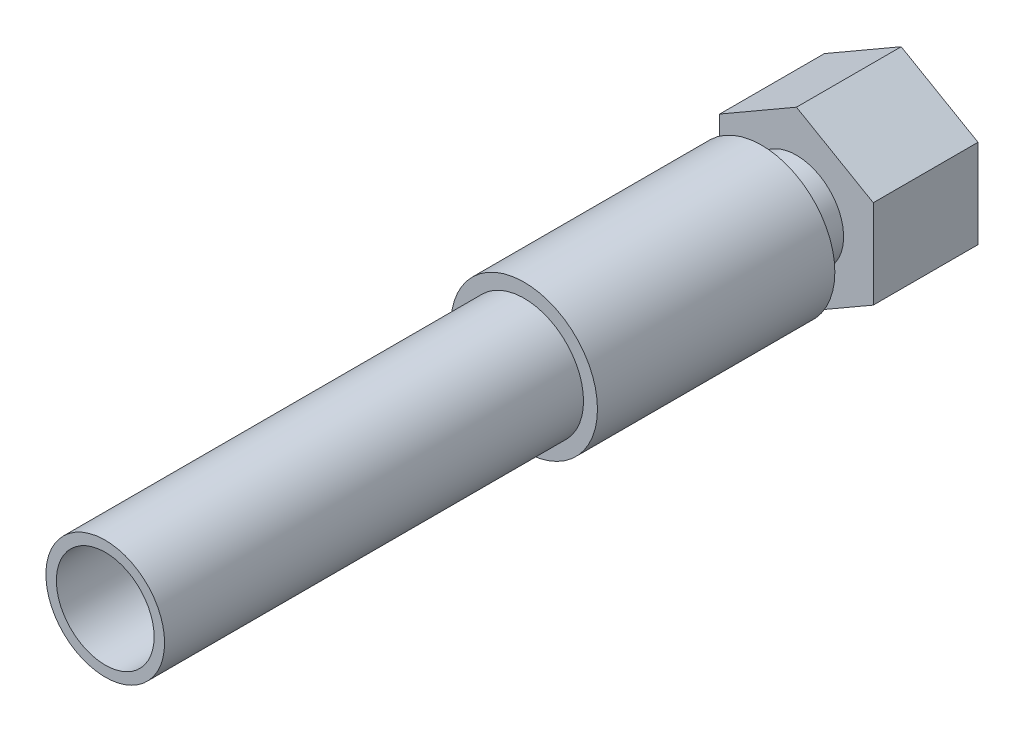
ISO-10303-21;
HEADER;
FILE_DESCRIPTION(('STEP AP214'),'2;1');
FILE_NAME('part.step','',(''),(''),'','','');
FILE_SCHEMA(('AUTOMOTIVE_DESIGN { 1 0 10303 214 1 1 1 1 }'));
ENDSEC;
DATA;
#1=APPLICATION_CONTEXT('core data for automotive mechanical design processes');
#2=APPLICATION_PROTOCOL_DEFINITION('international standard','automotive_design',2000,#1);
#3=PRODUCT_CONTEXT('',#1,'mechanical');
#4=PRODUCT('Part','Part','',(#3));
#5=PRODUCT_RELATED_PRODUCT_CATEGORY('part','',(#4));
#6=PRODUCT_DEFINITION_FORMATION('','',#4);
#7=PRODUCT_DEFINITION_CONTEXT('part definition',#1,'design');
#8=PRODUCT_DEFINITION('design','',#6,#7);
#9=PRODUCT_DEFINITION_SHAPE('','',#8);
#10=(LENGTH_UNIT() NAMED_UNIT(*) SI_UNIT(.MILLI.,.METRE.));
#11=(NAMED_UNIT(*) PLANE_ANGLE_UNIT() SI_UNIT($,.RADIAN.));
#12=(NAMED_UNIT(*) SI_UNIT($,.STERADIAN.) SOLID_ANGLE_UNIT());
#13=UNCERTAINTY_MEASURE_WITH_UNIT(LENGTH_MEASURE(1.E-05),#10,'distance_accuracy_value','');
#14=(GEOMETRIC_REPRESENTATION_CONTEXT(3) GLOBAL_UNCERTAINTY_ASSIGNED_CONTEXT((#13)) GLOBAL_UNIT_ASSIGNED_CONTEXT((#10,
#11,#12)) REPRESENTATION_CONTEXT('',''));
#15=CARTESIAN_POINT('',(0.,0.,0.));
#16=DIRECTION('',(0.,0.,1.));
#17=DIRECTION('',(1.,0.,0.));
#18=AXIS2_PLACEMENT_3D('',#15,#16,#17);
#19=CARTESIAN_POINT('',(0.,0.,54.0000000000001));
#20=DIRECTION('',(0.,0.,1.));
#21=DIRECTION('',(1.,0.,0.));
#22=AXIS2_PLACEMENT_3D('',#19,#20,#21);
#23=PLANE('',#22);
#24=CARTESIAN_POINT('',(0.,0.,54.0000000000001));
#25=DIRECTION('',(0.,0.,1.));
#26=DIRECTION('',(1.,0.,0.));
#27=AXIS2_PLACEMENT_3D('',#24,#25,#26);
#28=CIRCLE('',#27,10.5);
#29=CARTESIAN_POINT('',(10.5,0.,54.0000000000001));
#30=VERTEX_POINT('',#29);
#31=EDGE_CURVE('E167',#30,#30,#28,.T.);
#32=ORIENTED_EDGE('',*,*,#31,.T.);
#33=EDGE_LOOP('',(#32));
#34=FACE_BOUND('',#33,.T.);
#35=CARTESIAN_POINT('',(0.,0.,54.0000000000001));
#36=DIRECTION('',(0.,0.,1.));
#37=DIRECTION('',(1.,0.,0.));
#38=AXIS2_PLACEMENT_3D('',#35,#36,#37);
#39=CIRCLE('',#38,8.5);
#40=CARTESIAN_POINT('',(8.49999999999999,0.,54.0000000000001));
#41=VERTEX_POINT('',#40);
#42=EDGE_CURVE('E174',#41,#41,#39,.T.);
#43=ORIENTED_EDGE('',*,*,#42,.F.);
#44=EDGE_LOOP('',(#43));
#45=FACE_BOUND('',#44,.T.);
#46=ADVANCED_FACE('F34',(#34,#45),#23,.T.);
#47=CARTESIAN_POINT('',(11.,6.35085296108591,15.));
#48=DIRECTION('',(0.,0.,-1.));
#49=DIRECTION('',(-1.,0.,0.));
#50=AXIS2_PLACEMENT_3D('',#47,#48,#49);
#51=PLANE('',#50);
#52=DIRECTION('',(-0.866025403784439,0.5,0.));
#53=VECTOR('',#52,1.);
#54=CARTESIAN_POINT('',(11.,6.35085296108591,15.));
#55=LINE('',#54,#53);
#56=CARTESIAN_POINT('',(11.,6.35085296108591,15.));
#57=VERTEX_POINT('',#56);
#58=CARTESIAN_POINT('',(0.,12.7017059221719,15.));
#59=VERTEX_POINT('',#58);
#60=EDGE_CURVE('E133',#57,#59,#55,.T.);
#61=ORIENTED_EDGE('',*,*,#60,.T.);
#62=DIRECTION('',(-0.866025403784438,-0.5,0.));
#63=VECTOR('',#62,1.);
#64=CARTESIAN_POINT('',(0.,12.7017059221719,15.));
#65=LINE('',#64,#63);
#66=CARTESIAN_POINT('',(-11.,6.3508529610859,15.));
#67=VERTEX_POINT('',#66);
#68=EDGE_CURVE('E90',#59,#67,#65,.T.);
#69=ORIENTED_EDGE('',*,*,#68,.T.);
#70=DIRECTION('',(0.,-1.,0.));
#71=VECTOR('',#70,1.);
#72=CARTESIAN_POINT('',(-11.,6.3508529610859,15.));
#73=LINE('',#72,#71);
#74=CARTESIAN_POINT('',(-11.,-6.3508529610859,15.));
#75=VERTEX_POINT('',#74);
#76=EDGE_CURVE('E104',#67,#75,#73,.T.);
#77=ORIENTED_EDGE('',*,*,#76,.T.);
#78=DIRECTION('',(0.866025403784438,-0.5,0.));
#79=VECTOR('',#78,1.);
#80=CARTESIAN_POINT('',(-11.,-6.3508529610859,15.));
#81=LINE('',#80,#79);
#82=CARTESIAN_POINT('',(0.,-12.7017059221717,15.));
#83=VERTEX_POINT('',#82);
#84=EDGE_CURVE('E97',#75,#83,#81,.T.);
#85=ORIENTED_EDGE('',*,*,#84,.T.);
#86=DIRECTION('',(0.866025403784439,0.5,0.));
#87=VECTOR('',#86,1.);
#88=CARTESIAN_POINT('',(0.,-12.7017059221717,15.));
#89=LINE('',#88,#87);
#90=CARTESIAN_POINT('',(11.,-6.35085296108588,15.));
#91=VERTEX_POINT('',#90);
#92=EDGE_CURVE('E102',#83,#91,#89,.T.);
#93=ORIENTED_EDGE('',*,*,#92,.T.);
#94=DIRECTION('',(0.,1.,0.));
#95=VECTOR('',#94,1.);
#96=CARTESIAN_POINT('',(11.,-6.35085296108588,15.));
#97=LINE('',#96,#95);
#98=EDGE_CURVE('E52',#91,#57,#97,.T.);
#99=ORIENTED_EDGE('',*,*,#98,.T.);
#100=EDGE_LOOP('',(#61,#69,#77,#85,#93,#99));
#101=FACE_BOUND('',#100,.T.);
#102=CARTESIAN_POINT('',(0.,0.,15.));
#103=DIRECTION('',(0.,0.,-1.));
#104=DIRECTION('',(-1.,0.,0.));
#105=AXIS2_PLACEMENT_3D('',#102,#103,#104);
#106=CIRCLE('',#105,6.75);
#107=CARTESIAN_POINT('',(-6.75,0.,15.));
#108=VERTEX_POINT('',#107);
#109=EDGE_CURVE('E11',#108,#108,#106,.F.);
#110=ORIENTED_EDGE('',*,*,#109,.F.);
#111=EDGE_LOOP('',(#110));
#112=FACE_BOUND('',#111,.T.);
#113=ADVANCED_FACE('F99',(#101,#112),#51,.F.);
#114=CARTESIAN_POINT('',(11.,6.35085296108591,15.));
#115=DIRECTION('',(-0.5,-0.866025403784438,0.));
#116=DIRECTION('',(0.866025403784439,-0.5,0.));
#117=AXIS2_PLACEMENT_3D('',#114,#115,#116);
#118=PLANE('',#117);
#119=DIRECTION('',(-0.866025403784439,0.5,0.));
#120=VECTOR('',#119,1.);
#121=CARTESIAN_POINT('',(11.,6.3508529610859,0.));
#122=LINE('',#121,#120);
#123=CARTESIAN_POINT('',(11.,6.3508529610859,0.));
#124=VERTEX_POINT('',#123);
#125=CARTESIAN_POINT('',(0.,12.7017059221718,0.));
#126=VERTEX_POINT('',#125);
#127=EDGE_CURVE('E122',#124,#126,#122,.T.);
#128=ORIENTED_EDGE('',*,*,#127,.T.);
#129=DIRECTION('',(0.,0.,-1.));
#130=VECTOR('',#129,1.);
#131=CARTESIAN_POINT('',(0.,12.7017059221719,15.));
#132=LINE('',#131,#130);
#133=EDGE_CURVE('E44',#59,#126,#132,.T.);
#134=ORIENTED_EDGE('',*,*,#133,.F.);
#135=ORIENTED_EDGE('',*,*,#60,.F.);
#136=DIRECTION('',(0.,0.,-1.));
#137=VECTOR('',#136,1.);
#138=CARTESIAN_POINT('',(11.,6.35085296108591,15.));
#139=LINE('',#138,#137);
#140=EDGE_CURVE('E118',#57,#124,#139,.T.);
#141=ORIENTED_EDGE('',*,*,#140,.T.);
#142=EDGE_LOOP('',(#128,#134,#135,#141));
#143=FACE_BOUND('',#142,.T.);
#144=ADVANCED_FACE('F36',(#143),#118,.F.);
#145=CARTESIAN_POINT('',(0.,12.7017059221719,15.));
#146=DIRECTION('',(0.5,-0.866025403784438,0.));
#147=DIRECTION('',(0.866025403784439,0.5,0.));
#148=AXIS2_PLACEMENT_3D('',#145,#146,#147);
#149=PLANE('',#148);
#150=DIRECTION('',(-0.866025403784438,-0.5,0.));
#151=VECTOR('',#150,1.);
#152=CARTESIAN_POINT('',(0.,12.7017059221718,0.));
#153=LINE('',#152,#151);
#154=CARTESIAN_POINT('',(-11.,6.3508529610859,0.));
#155=VERTEX_POINT('',#154);
#156=EDGE_CURVE('E125',#126,#155,#153,.T.);
#157=ORIENTED_EDGE('',*,*,#156,.T.);
#158=DIRECTION('',(0.,0.,-1.));
#159=VECTOR('',#158,1.);
#160=CARTESIAN_POINT('',(-11.,6.3508529610859,15.));
#161=LINE('',#160,#159);
#162=EDGE_CURVE('E137',#67,#155,#161,.T.);
#163=ORIENTED_EDGE('',*,*,#162,.F.);
#164=ORIENTED_EDGE('',*,*,#68,.F.);
#165=ORIENTED_EDGE('',*,*,#133,.T.);
#166=EDGE_LOOP('',(#157,#163,#164,#165));
#167=FACE_BOUND('',#166,.T.);
#168=ADVANCED_FACE('F141',(#167),#149,.F.);
#169=CARTESIAN_POINT('',(-11.,6.3508529610859,15.));
#170=DIRECTION('',(1.,0.,0.));
#171=DIRECTION('',(0.,0.,-1.));
#172=AXIS2_PLACEMENT_3D('',#169,#170,#171);
#173=PLANE('',#172);
#174=DIRECTION('',(0.,-1.,0.));
#175=VECTOR('',#174,1.);
#176=CARTESIAN_POINT('',(-11.,6.3508529610859,0.));
#177=LINE('',#176,#175);
#178=CARTESIAN_POINT('',(-11.,-6.3508529610859,0.));
#179=VERTEX_POINT('',#178);
#180=EDGE_CURVE('E128',#155,#179,#177,.T.);
#181=ORIENTED_EDGE('',*,*,#180,.T.);
#182=DIRECTION('',(0.,0.,-1.));
#183=VECTOR('',#182,1.);
#184=CARTESIAN_POINT('',(-11.,-6.3508529610859,15.));
#185=LINE('',#184,#183);
#186=EDGE_CURVE('E113',#75,#179,#185,.T.);
#187=ORIENTED_EDGE('',*,*,#186,.F.);
#188=ORIENTED_EDGE('',*,*,#76,.F.);
#189=ORIENTED_EDGE('',*,*,#162,.T.);
#190=EDGE_LOOP('',(#181,#187,#188,#189));
#191=FACE_BOUND('',#190,.T.);
#192=ADVANCED_FACE('F149',(#191),#173,.F.);
#193=CARTESIAN_POINT('',(-11.,-6.3508529610859,15.));
#194=DIRECTION('',(0.5,0.866025403784438,0.));
#195=DIRECTION('',(-0.866025403784439,0.5,0.));
#196=AXIS2_PLACEMENT_3D('',#193,#194,#195);
#197=PLANE('',#196);
#198=DIRECTION('',(0.866025403784438,-0.5,0.));
#199=VECTOR('',#198,1.);
#200=CARTESIAN_POINT('',(-11.,-6.3508529610859,0.));
#201=LINE('',#200,#199);
#202=CARTESIAN_POINT('',(0.,-12.7017059221717,0.));
#203=VERTEX_POINT('',#202);
#204=EDGE_CURVE('E112',#179,#203,#201,.T.);
#205=ORIENTED_EDGE('',*,*,#204,.T.);
#206=DIRECTION('',(0.,0.,-1.));
#207=VECTOR('',#206,1.);
#208=CARTESIAN_POINT('',(0.,-12.7017059221717,15.));
#209=LINE('',#208,#207);
#210=EDGE_CURVE('E109',#83,#203,#209,.T.);
#211=ORIENTED_EDGE('',*,*,#210,.F.);
#212=ORIENTED_EDGE('',*,*,#84,.F.);
#213=ORIENTED_EDGE('',*,*,#186,.T.);
#214=EDGE_LOOP('',(#205,#211,#212,#213));
#215=FACE_BOUND('',#214,.T.);
#216=ADVANCED_FACE('F110',(#215),#197,.F.);
#217=CARTESIAN_POINT('',(0.,-12.7017059221717,15.));
#218=DIRECTION('',(-0.5,0.866025403784439,0.));
#219=DIRECTION('',(-0.866025403784439,-0.5,0.));
#220=AXIS2_PLACEMENT_3D('',#217,#218,#219);
#221=PLANE('',#220);
#222=DIRECTION('',(0.866025403784439,0.5,0.));
#223=VECTOR('',#222,1.);
#224=CARTESIAN_POINT('',(0.,-12.7017059221717,0.));
#225=LINE('',#224,#223);
#226=CARTESIAN_POINT('',(11.,-6.3508529610859,0.));
#227=VERTEX_POINT('',#226);
#228=EDGE_CURVE('E75',#203,#227,#225,.T.);
#229=ORIENTED_EDGE('',*,*,#228,.T.);
#230=DIRECTION('',(0.,0.,-1.));
#231=VECTOR('',#230,1.);
#232=CARTESIAN_POINT('',(11.,-6.35085296108588,15.));
#233=LINE('',#232,#231);
#234=EDGE_CURVE('E114',#91,#227,#233,.T.);
#235=ORIENTED_EDGE('',*,*,#234,.F.);
#236=ORIENTED_EDGE('',*,*,#92,.F.);
#237=ORIENTED_EDGE('',*,*,#210,.T.);
#238=EDGE_LOOP('',(#229,#235,#236,#237));
#239=FACE_BOUND('',#238,.T.);
#240=ADVANCED_FACE('F116',(#239),#221,.F.);
#241=CARTESIAN_POINT('',(11.,-6.35085296108588,15.));
#242=DIRECTION('',(-1.,0.,0.));
#243=DIRECTION('',(0.,-1.,0.));
#244=AXIS2_PLACEMENT_3D('',#241,#242,#243);
#245=PLANE('',#244);
#246=DIRECTION('',(0.,1.,0.));
#247=VECTOR('',#246,1.);
#248=CARTESIAN_POINT('',(11.,-6.3508529610859,0.));
#249=LINE('',#248,#247);
#250=EDGE_CURVE('E81',#227,#124,#249,.T.);
#251=ORIENTED_EDGE('',*,*,#250,.T.);
#252=ORIENTED_EDGE('',*,*,#140,.F.);
#253=ORIENTED_EDGE('',*,*,#98,.F.);
#254=ORIENTED_EDGE('',*,*,#234,.T.);
#255=EDGE_LOOP('',(#251,#252,#253,#254));
#256=FACE_BOUND('',#255,.T.);
#257=ADVANCED_FACE('F253',(#256),#245,.F.);
#258=CARTESIAN_POINT('',(11.,6.3508529610859,0.));
#259=DIRECTION('',(0.,0.,-1.));
#260=DIRECTION('',(-1.,0.,0.));
#261=AXIS2_PLACEMENT_3D('',#258,#259,#260);
#262=PLANE('',#261);
#263=CARTESIAN_POINT('',(0.,0.,0.));
#264=DIRECTION('',(0.,0.,-1.));
#265=DIRECTION('',(-1.,0.,0.));
#266=AXIS2_PLACEMENT_3D('',#263,#264,#265);
#267=CIRCLE('',#266,8.331);
#268=CARTESIAN_POINT('',(-8.331,0.,0.));
#269=VERTEX_POINT('',#268);
#270=EDGE_CURVE('E153',#269,#269,#267,.T.);
#271=ORIENTED_EDGE('',*,*,#270,.F.);
#272=EDGE_LOOP('',(#271));
#273=FACE_BOUND('',#272,.T.);
#274=ORIENTED_EDGE('',*,*,#127,.F.);
#275=ORIENTED_EDGE('',*,*,#250,.F.);
#276=ORIENTED_EDGE('',*,*,#228,.F.);
#277=ORIENTED_EDGE('',*,*,#204,.F.);
#278=ORIENTED_EDGE('',*,*,#180,.F.);
#279=ORIENTED_EDGE('',*,*,#156,.F.);
#280=EDGE_LOOP('',(#274,#275,#276,#277,#278,#279));
#281=FACE_BOUND('',#280,.T.);
#282=ADVANCED_FACE('F146',(#273,#281),#262,.T.);
#283=CARTESIAN_POINT('',(0.,0.,12.));
#284=DIRECTION('',(0.,0.,-1.));
#285=DIRECTION('',(-1.,0.,0.));
#286=AXIS2_PLACEMENT_3D('',#283,#284,#285);
#287=CYLINDRICAL_SURFACE('',#286,8.331);
#288=CARTESIAN_POINT('',(0.,0.,12.));
#289=DIRECTION('',(0.,0.,-1.));
#290=DIRECTION('',(-1.,0.,0.));
#291=AXIS2_PLACEMENT_3D('',#288,#289,#290);
#292=CIRCLE('',#291,8.331);
#293=CARTESIAN_POINT('',(-8.331,0.,12.));
#294=VERTEX_POINT('',#293);
#295=EDGE_CURVE('E126',#294,#294,#292,.T.);
#296=ORIENTED_EDGE('',*,*,#295,.F.);
#297=EDGE_LOOP('',(#296));
#298=FACE_BOUND('',#297,.T.);
#299=ORIENTED_EDGE('',*,*,#270,.T.);
#300=EDGE_LOOP('',(#299));
#301=FACE_BOUND('',#300,.T.);
#302=ADVANCED_FACE('F246',(#298,#301),#287,.F.);
#303=CARTESIAN_POINT('',(0.,0.,12.));
#304=DIRECTION('',(0.,0.,-1.));
#305=DIRECTION('',(-1.,0.,0.));
#306=AXIS2_PLACEMENT_3D('',#303,#304,#305);
#307=PLANE('',#306);
#308=CARTESIAN_POINT('',(0.,0.,12.));
#309=DIRECTION('',(0.,0.,-1.));
#310=DIRECTION('',(-1.,0.,0.));
#311=AXIS2_PLACEMENT_3D('',#308,#309,#310);
#312=CIRCLE('',#311,7.);
#313=CARTESIAN_POINT('',(-7.,0.,12.));
#314=VERTEX_POINT('',#313);
#315=EDGE_CURVE('E156',#314,#314,#312,.T.);
#316=ORIENTED_EDGE('',*,*,#315,.F.);
#317=EDGE_LOOP('',(#316));
#318=FACE_BOUND('',#317,.T.);
#319=ORIENTED_EDGE('',*,*,#295,.T.);
#320=EDGE_LOOP('',(#319));
#321=FACE_BOUND('',#320,.T.);
#322=ADVANCED_FACE('F242',(#318,#321),#307,.T.);
#323=CARTESIAN_POINT('',(0.,0.,12.));
#324=DIRECTION('',(0.,0.,-1.));
#325=DIRECTION('',(-1.,0.,0.));
#326=AXIS2_PLACEMENT_3D('',#323,#324,#325);
#327=CYLINDRICAL_SURFACE('',#326,7.);
#328=ORIENTED_EDGE('',*,*,#315,.T.);
#329=EDGE_LOOP('',(#328));
#330=FACE_BOUND('',#329,.T.);
#331=CARTESIAN_POINT('',(0.,0.,0.));
#332=DIRECTION('',(0.,0.,-1.));
#333=DIRECTION('',(-1.,0.,0.));
#334=AXIS2_PLACEMENT_3D('',#331,#332,#333);
#335=CIRCLE('',#334,7.);
#336=CARTESIAN_POINT('',(-7.,0.,0.));
#337=VERTEX_POINT('',#336);
#338=EDGE_CURVE('E159',#337,#337,#335,.T.);
#339=ORIENTED_EDGE('',*,*,#338,.F.);
#340=EDGE_LOOP('',(#339));
#341=FACE_BOUND('',#340,.T.);
#342=ADVANCED_FACE('F239',(#330,#341),#327,.T.);
#343=CARTESIAN_POINT('',(0.,0.,0.));
#344=DIRECTION('',(0.,0.,-1.));
#345=DIRECTION('',(-1.,0.,0.));
#346=AXIS2_PLACEMENT_3D('',#343,#344,#345);
#347=CIRCLE('',#346,3.5);
#348=CARTESIAN_POINT('',(-3.5,0.,0.));
#349=VERTEX_POINT('',#348);
#350=EDGE_CURVE('E185',#349,#349,#347,.T.);
#351=ORIENTED_EDGE('',*,*,#350,.F.);
#352=EDGE_LOOP('',(#351));
#353=FACE_BOUND('',#352,.T.);
#354=ORIENTED_EDGE('',*,*,#338,.T.);
#355=EDGE_LOOP('',(#354));
#356=FACE_BOUND('',#355,.T.);
#357=ADVANCED_FACE('F237',(#353,#356),#262,.T.);
#358=CARTESIAN_POINT('',(0.,0.,20.));
#359=DIRECTION('',(0.,0.,-1.));
#360=DIRECTION('',(-1.,0.,0.));
#361=AXIS2_PLACEMENT_3D('',#358,#359,#360);
#362=CYLINDRICAL_SURFACE('',#361,6.75);
#363=CARTESIAN_POINT('',(0.,0.,20.));
#364=DIRECTION('',(0.,0.,1.));
#365=DIRECTION('',(1.,0.,0.));
#366=AXIS2_PLACEMENT_3D('',#363,#364,#365);
#367=CIRCLE('',#366,6.75);
#368=CARTESIAN_POINT('',(6.74999999999999,0.,20.));
#369=VERTEX_POINT('',#368);
#370=EDGE_CURVE('E162',#369,#369,#367,.T.);
#371=ORIENTED_EDGE('',*,*,#370,.F.);
#372=EDGE_LOOP('',(#371));
#373=FACE_BOUND('',#372,.T.);
#374=ORIENTED_EDGE('',*,*,#109,.T.);
#375=EDGE_LOOP('',(#374));
#376=FACE_BOUND('',#375,.T.);
#377=ADVANCED_FACE('F230',(#373,#376),#362,.T.);
#378=CARTESIAN_POINT('',(0.,0.,20.));
#379=DIRECTION('',(0.,0.,1.));
#380=DIRECTION('',(1.,0.,0.));
#381=AXIS2_PLACEMENT_3D('',#378,#379,#380);
#382=PLANE('',#381);
#383=CARTESIAN_POINT('',(0.,0.,20.));
#384=DIRECTION('',(0.,0.,1.));
#385=DIRECTION('',(1.,0.,0.));
#386=AXIS2_PLACEMENT_3D('',#383,#384,#385);
#387=CIRCLE('',#386,10.5);
#388=CARTESIAN_POINT('',(10.5,0.,20.));
#389=VERTEX_POINT('',#388);
#390=EDGE_CURVE('E168',#389,#389,#387,.T.);
#391=ORIENTED_EDGE('',*,*,#390,.F.);
#392=EDGE_LOOP('',(#391));
#393=FACE_BOUND('',#392,.T.);
#394=ORIENTED_EDGE('',*,*,#370,.T.);
#395=EDGE_LOOP('',(#394));
#396=FACE_BOUND('',#395,.T.);
#397=ADVANCED_FACE('F227',(#393,#396),#382,.F.);
#398=CARTESIAN_POINT('',(0.,0.,54.0000000000001));
#399=DIRECTION('',(0.,0.,-1.));
#400=DIRECTION('',(-1.,0.,0.));
#401=AXIS2_PLACEMENT_3D('',#398,#399,#400);
#402=CYLINDRICAL_SURFACE('',#401,10.5);
#403=ORIENTED_EDGE('',*,*,#31,.F.);
#404=EDGE_LOOP('',(#403));
#405=FACE_BOUND('',#404,.T.);
#406=ORIENTED_EDGE('',*,*,#390,.T.);
#407=EDGE_LOOP('',(#406));
#408=FACE_BOUND('',#407,.T.);
#409=ADVANCED_FACE('F215',(#405,#408),#402,.T.);
#410=CARTESIAN_POINT('',(0.,0.,114.));
#411=DIRECTION('',(0.,0.,-1.));
#412=DIRECTION('',(-1.,0.,0.));
#413=AXIS2_PLACEMENT_3D('',#410,#411,#412);
#414=CYLINDRICAL_SURFACE('',#413,8.5);
#415=CARTESIAN_POINT('',(0.,0.,114.));
#416=DIRECTION('',(0.,0.,1.));
#417=DIRECTION('',(1.,0.,0.));
#418=AXIS2_PLACEMENT_3D('',#415,#416,#417);
#419=CIRCLE('',#418,8.5);
#420=CARTESIAN_POINT('',(8.49999999999999,0.,114.));
#421=VERTEX_POINT('',#420);
#422=EDGE_CURVE('E171',#421,#421,#419,.T.);
#423=ORIENTED_EDGE('',*,*,#422,.F.);
#424=EDGE_LOOP('',(#423));
#425=FACE_BOUND('',#424,.T.);
#426=ORIENTED_EDGE('',*,*,#42,.T.);
#427=EDGE_LOOP('',(#426));
#428=FACE_BOUND('',#427,.T.);
#429=ADVANCED_FACE('F209',(#425,#428),#414,.T.);
#430=CARTESIAN_POINT('',(0.,0.,114.));
#431=DIRECTION('',(0.,0.,1.));
#432=DIRECTION('',(1.,0.,0.));
#433=AXIS2_PLACEMENT_3D('',#430,#431,#432);
#434=PLANE('',#433);
#435=CARTESIAN_POINT('',(0.,0.,114.));
#436=DIRECTION('',(0.,0.,1.));
#437=DIRECTION('',(1.,0.,0.));
#438=AXIS2_PLACEMENT_3D('',#435,#436,#437);
#439=CIRCLE('',#438,7.);
#440=CARTESIAN_POINT('',(6.99999999999999,0.,114.));
#441=VERTEX_POINT('',#440);
#442=EDGE_CURVE('E180',#441,#441,#439,.T.);
#443=ORIENTED_EDGE('',*,*,#442,.F.);
#444=EDGE_LOOP('',(#443));
#445=FACE_BOUND('',#444,.T.);
#446=ORIENTED_EDGE('',*,*,#422,.T.);
#447=EDGE_LOOP('',(#446));
#448=FACE_BOUND('',#447,.T.);
#449=ADVANCED_FACE('F203',(#445,#448),#434,.T.);
#450=CARTESIAN_POINT('',(0.,0.,54.0000000000001));
#451=DIRECTION('',(0.,0.,1.));
#452=DIRECTION('',(1.,0.,0.));
#453=AXIS2_PLACEMENT_3D('',#450,#451,#452);
#454=CYLINDRICAL_SURFACE('',#453,7.);
#455=CARTESIAN_POINT('',(0.,0.,54.0000000000001));
#456=DIRECTION('',(0.,0.,1.));
#457=DIRECTION('',(1.,0.,0.));
#458=AXIS2_PLACEMENT_3D('',#455,#456,#457);
#459=CIRCLE('',#458,7.);
#460=CARTESIAN_POINT('',(6.99999999999999,0.,54.0000000000001));
#461=VERTEX_POINT('',#460);
#462=EDGE_CURVE('E177',#461,#461,#459,.T.);
#463=ORIENTED_EDGE('',*,*,#462,.F.);
#464=EDGE_LOOP('',(#463));
#465=FACE_BOUND('',#464,.T.);
#466=ORIENTED_EDGE('',*,*,#442,.T.);
#467=EDGE_LOOP('',(#466));
#468=FACE_BOUND('',#467,.T.);
#469=ADVANCED_FACE('F197',(#465,#468),#454,.F.);
#470=CARTESIAN_POINT('',(0.,0.,54.0000000000001));
#471=DIRECTION('',(0.,0.,1.));
#472=DIRECTION('',(1.,0.,0.));
#473=AXIS2_PLACEMENT_3D('',#470,#471,#472);
#474=PLANE('',#473);
#475=CARTESIAN_POINT('',(0.,0.,54.0000000000001));
#476=DIRECTION('',(0.,0.,1.));
#477=DIRECTION('',(1.,0.,0.));
#478=AXIS2_PLACEMENT_3D('',#475,#476,#477);
#479=CIRCLE('',#478,3.5);
#480=CARTESIAN_POINT('',(3.5,0.,54.0000000000001));
#481=VERTEX_POINT('',#480);
#482=EDGE_CURVE('E38',#481,#481,#479,.T.);
#483=ORIENTED_EDGE('',*,*,#482,.F.);
#484=EDGE_LOOP('',(#483));
#485=FACE_BOUND('',#484,.T.);
#486=ORIENTED_EDGE('',*,*,#462,.T.);
#487=EDGE_LOOP('',(#486));
#488=FACE_BOUND('',#487,.T.);
#489=ADVANCED_FACE('F194',(#485,#488),#474,.T.);
#490=CARTESIAN_POINT('',(0.,0.,114.));
#491=DIRECTION('',(0.,0.,-1.));
#492=DIRECTION('',(-1.,0.,0.));
#493=AXIS2_PLACEMENT_3D('',#490,#491,#492);
#494=CYLINDRICAL_SURFACE('',#493,3.5);
#495=ORIENTED_EDGE('',*,*,#482,.T.);
#496=EDGE_LOOP('',(#495));
#497=FACE_BOUND('',#496,.T.);
#498=ORIENTED_EDGE('',*,*,#350,.T.);
#499=EDGE_LOOP('',(#498));
#500=FACE_BOUND('',#499,.T.);
#501=ADVANCED_FACE('F192',(#497,#500),#494,.F.);
#502=CLOSED_SHELL('',(#46,#113,#144,#168,#192,#216,#240,#257,#282,#302,#322,#342,#357,#377,#397,
#409,#429,#449,#469,#489,#501));
#503=MANIFOLD_SOLID_BREP('B2',#502);
#504=ADVANCED_BREP_SHAPE_REPRESENTATION('',(#18,#503),#14);
#505=SHAPE_DEFINITION_REPRESENTATION(#9,#504);
ENDSEC;
END-ISO-10303-21;
